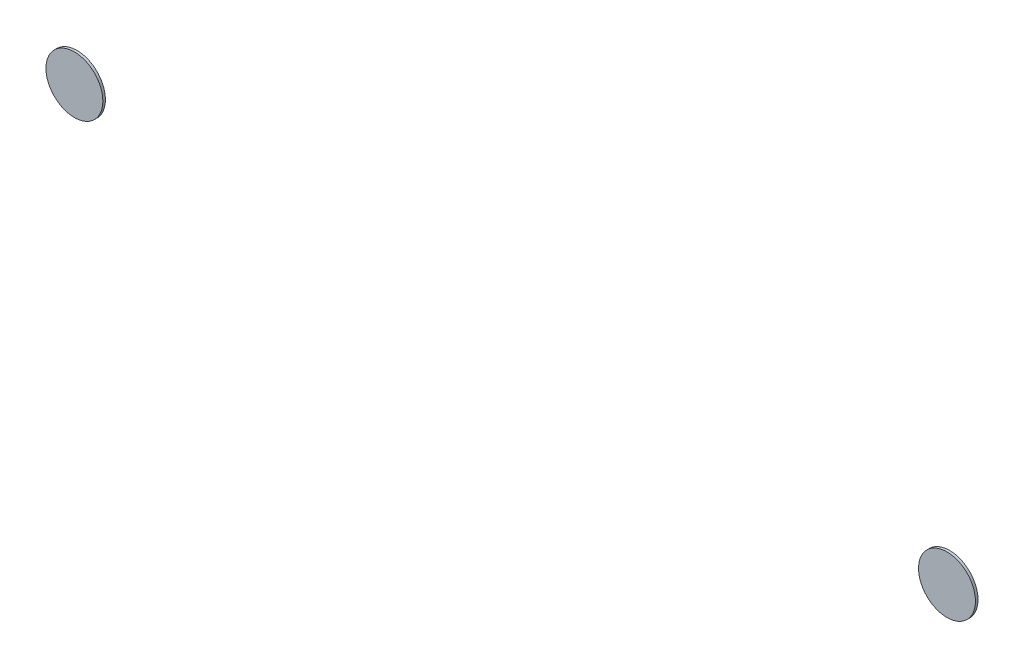
ISO-10303-21;
HEADER;
FILE_DESCRIPTION(('STEP AP214'),'2;1');
FILE_NAME('part.step','',(''),(''),'','','');
FILE_SCHEMA(('AUTOMOTIVE_DESIGN { 1 0 10303 214 1 1 1 1 }'));
ENDSEC;
DATA;
#1=APPLICATION_CONTEXT('core data for automotive mechanical design processes');
#2=APPLICATION_PROTOCOL_DEFINITION('international standard','automotive_design',2000,#1);
#3=PRODUCT_CONTEXT('',#1,'mechanical');
#4=PRODUCT('Part','Part','',(#3));
#5=PRODUCT_RELATED_PRODUCT_CATEGORY('part','',(#4));
#6=PRODUCT_DEFINITION_FORMATION('','',#4);
#7=PRODUCT_DEFINITION_CONTEXT('part definition',#1,'design');
#8=PRODUCT_DEFINITION('design','',#6,#7);
#9=PRODUCT_DEFINITION_SHAPE('','',#8);
#10=(LENGTH_UNIT() NAMED_UNIT(*) SI_UNIT(.MILLI.,.METRE.));
#11=(NAMED_UNIT(*) PLANE_ANGLE_UNIT() SI_UNIT($,.RADIAN.));
#12=(NAMED_UNIT(*) SI_UNIT($,.STERADIAN.) SOLID_ANGLE_UNIT());
#13=UNCERTAINTY_MEASURE_WITH_UNIT(LENGTH_MEASURE(1.E-05),#10,'distance_accuracy_value','');
#14=(GEOMETRIC_REPRESENTATION_CONTEXT(3) GLOBAL_UNCERTAINTY_ASSIGNED_CONTEXT((#13)) GLOBAL_UNIT_ASSIGNED_CONTEXT((#10,
#11,#12)) REPRESENTATION_CONTEXT('',''));
#15=CARTESIAN_POINT('',(0.,0.,0.));
#16=DIRECTION('',(0.,0.,1.));
#17=DIRECTION('',(1.,0.,0.));
#18=AXIS2_PLACEMENT_3D('',#15,#16,#17);
#19=CARTESIAN_POINT('',(5.34772700825847,19.6361120062389,0.1));
#20=DIRECTION('',(0.,0.,-1.));
#21=DIRECTION('',(-1.,0.,0.));
#22=AXIS2_PLACEMENT_3D('',#19,#20,#21);
#23=CYLINDRICAL_SURFACE('',#22,1.10548094855146);
#24=CARTESIAN_POINT('',(5.34772700825847,19.6361120062389,0.1));
#25=DIRECTION('',(0.,0.,1.));
#26=DIRECTION('',(1.,0.,0.));
#27=AXIS2_PLACEMENT_3D('',#24,#25,#26);
#28=CIRCLE('',#27,1.10548094855146);
#29=CARTESIAN_POINT('',(6.45320795680993,19.6361120062389,0.1));
#30=VERTEX_POINT('',#29);
#31=EDGE_CURVE('E11',#30,#30,#28,.T.);
#32=ORIENTED_EDGE('',*,*,#31,.F.);
#33=EDGE_LOOP('',(#32));
#34=FACE_BOUND('',#33,.T.);
#35=CARTESIAN_POINT('',(5.34772700825847,19.6361120062389,0.));
#36=DIRECTION('',(0.,0.,1.));
#37=DIRECTION('',(1.,0.,0.));
#38=AXIS2_PLACEMENT_3D('',#35,#36,#37);
#39=CIRCLE('',#38,1.10548094855146);
#40=CARTESIAN_POINT('',(6.45320795680993,19.6361120062389,0.));
#41=VERTEX_POINT('',#40);
#42=EDGE_CURVE('E41',#41,#41,#39,.T.);
#43=ORIENTED_EDGE('',*,*,#42,.T.);
#44=EDGE_LOOP('',(#43));
#45=FACE_BOUND('',#44,.T.);
#46=ADVANCED_FACE('F38',(#34,#45),#23,.T.);
#47=CARTESIAN_POINT('',(5.34772700825847,19.6361120062389,0.1));
#48=DIRECTION('',(0.,0.,1.));
#49=DIRECTION('',(1.,0.,0.));
#50=AXIS2_PLACEMENT_3D('',#47,#48,#49);
#51=PLANE('',#50);
#52=ORIENTED_EDGE('',*,*,#31,.T.);
#53=EDGE_LOOP('',(#52));
#54=FACE_BOUND('',#53,.T.);
#55=ADVANCED_FACE('F53',(#54),#51,.T.);
#56=CARTESIAN_POINT('',(5.34772700825847,19.6361120062389,0.));
#57=DIRECTION('',(0.,0.,1.));
#58=DIRECTION('',(1.,0.,0.));
#59=AXIS2_PLACEMENT_3D('',#56,#57,#58);
#60=PLANE('',#59);
#61=ORIENTED_EDGE('',*,*,#42,.F.);
#62=EDGE_LOOP('',(#61));
#63=FACE_BOUND('',#62,.T.);
#64=ADVANCED_FACE('F51',(#63),#60,.F.);
#65=CLOSED_SHELL('',(#46,#55,#64));
#66=MANIFOLD_SOLID_BREP('B2',#65);
#67=CARTESIAN_POINT('',(39.2522729917415,19.7638879937611,0.1));
#68=DIRECTION('',(0.,0.,-1.));
#69=DIRECTION('',(-1.,0.,0.));
#70=AXIS2_PLACEMENT_3D('',#67,#68,#69);
#71=CYLINDRICAL_SURFACE('',#70,1.10548094855146);
#72=CARTESIAN_POINT('',(39.2522729917415,19.7638879937611,0.1));
#73=DIRECTION('',(0.,0.,1.));
#74=DIRECTION('',(1.,0.,0.));
#75=AXIS2_PLACEMENT_3D('',#72,#73,#74);
#76=CIRCLE('',#75,1.10548094855146);
#77=CARTESIAN_POINT('',(40.357753940293,19.7638879937611,0.1));
#78=VERTEX_POINT('',#77);
#79=EDGE_CURVE('E37',#78,#78,#76,.T.);
#80=ORIENTED_EDGE('',*,*,#79,.F.);
#81=EDGE_LOOP('',(#80));
#82=FACE_BOUND('',#81,.T.);
#83=CARTESIAN_POINT('',(39.2522729917415,19.7638879937611,0.));
#84=DIRECTION('',(0.,0.,1.));
#85=DIRECTION('',(1.,0.,0.));
#86=AXIS2_PLACEMENT_3D('',#83,#84,#85);
#87=CIRCLE('',#86,1.10548094855146);
#88=CARTESIAN_POINT('',(40.357753940293,19.7638879937611,0.));
#89=VERTEX_POINT('',#88);
#90=EDGE_CURVE('E81',#89,#89,#87,.T.);
#91=ORIENTED_EDGE('',*,*,#90,.T.);
#92=EDGE_LOOP('',(#91));
#93=FACE_BOUND('',#92,.T.);
#94=ADVANCED_FACE('F78',(#82,#93),#71,.T.);
#95=CARTESIAN_POINT('',(39.2522729917415,19.7638879937611,0.1));
#96=DIRECTION('',(0.,0.,1.));
#97=DIRECTION('',(1.,0.,0.));
#98=AXIS2_PLACEMENT_3D('',#95,#96,#97);
#99=PLANE('',#98);
#100=ORIENTED_EDGE('',*,*,#79,.T.);
#101=EDGE_LOOP('',(#100));
#102=FACE_BOUND('',#101,.T.);
#103=ADVANCED_FACE('F93',(#102),#99,.T.);
#104=CARTESIAN_POINT('',(39.2522729917415,19.7638879937611,0.));
#105=DIRECTION('',(0.,0.,1.));
#106=DIRECTION('',(1.,0.,0.));
#107=AXIS2_PLACEMENT_3D('',#104,#105,#106);
#108=PLANE('',#107);
#109=ORIENTED_EDGE('',*,*,#90,.F.);
#110=EDGE_LOOP('',(#109));
#111=FACE_BOUND('',#110,.T.);
#112=ADVANCED_FACE('F91',(#111),#108,.F.);
#113=CLOSED_SHELL('',(#94,#103,#112));
#114=MANIFOLD_SOLID_BREP('B6',#113);
#115=ADVANCED_BREP_SHAPE_REPRESENTATION('',(#18,#66,#114),#14);
#116=SHAPE_DEFINITION_REPRESENTATION(#9,#115);
ENDSEC;
END-ISO-10303-21;
